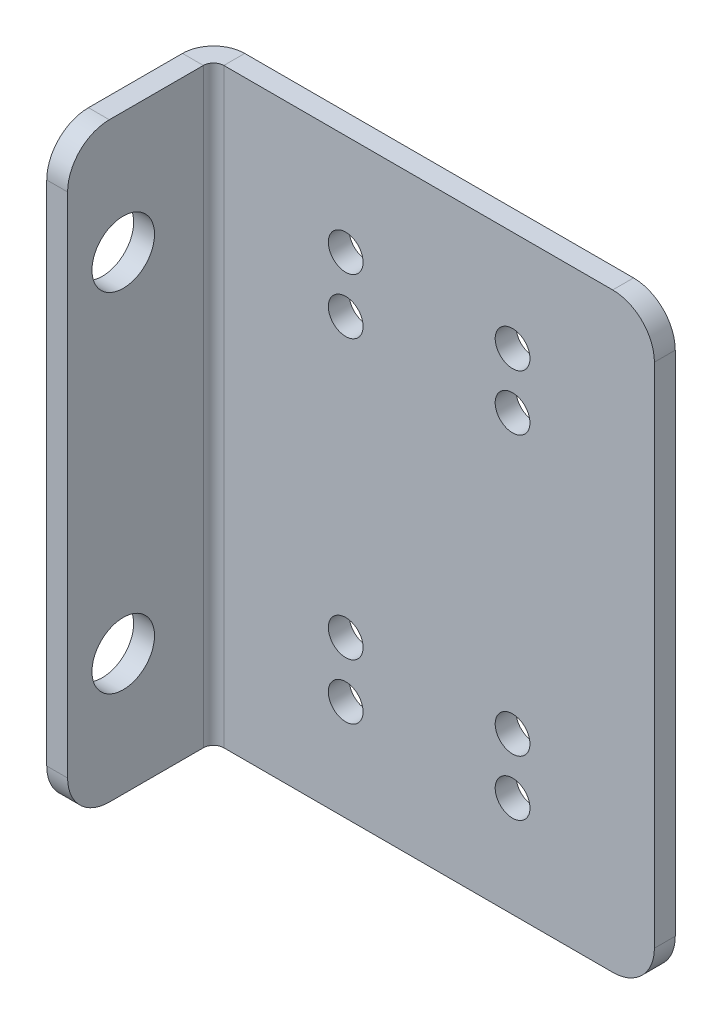
ISO-10303-21;
HEADER;
FILE_DESCRIPTION(('STEP AP214'),'2;1');
FILE_NAME('part.step','',(''),(''),'','','');
FILE_SCHEMA(('AUTOMOTIVE_DESIGN { 1 0 10303 214 1 1 1 1 }'));
ENDSEC;
DATA;
#1=APPLICATION_CONTEXT('core data for automotive mechanical design processes');
#2=APPLICATION_PROTOCOL_DEFINITION('international standard','automotive_design',2000,#1);
#3=PRODUCT_CONTEXT('',#1,'mechanical');
#4=PRODUCT('Part','Part','',(#3));
#5=PRODUCT_RELATED_PRODUCT_CATEGORY('part','',(#4));
#6=PRODUCT_DEFINITION_FORMATION('','',#4);
#7=PRODUCT_DEFINITION_CONTEXT('part definition',#1,'design');
#8=PRODUCT_DEFINITION('design','',#6,#7);
#9=PRODUCT_DEFINITION_SHAPE('','',#8);
#10=(LENGTH_UNIT() NAMED_UNIT(*) SI_UNIT(.MILLI.,.METRE.));
#11=(NAMED_UNIT(*) PLANE_ANGLE_UNIT() SI_UNIT($,.RADIAN.));
#12=(NAMED_UNIT(*) SI_UNIT($,.STERADIAN.) SOLID_ANGLE_UNIT());
#13=UNCERTAINTY_MEASURE_WITH_UNIT(LENGTH_MEASURE(1.E-05),#10,'distance_accuracy_value','');
#14=(GEOMETRIC_REPRESENTATION_CONTEXT(3) GLOBAL_UNCERTAINTY_ASSIGNED_CONTEXT((#13)) GLOBAL_UNIT_ASSIGNED_CONTEXT((#10,
#11,#12)) REPRESENTATION_CONTEXT('',''));
#15=CARTESIAN_POINT('',(0.,0.,0.));
#16=DIRECTION('',(0.,0.,1.));
#17=DIRECTION('',(1.,0.,0.));
#18=AXIS2_PLACEMENT_3D('',#15,#16,#17);
#19=CARTESIAN_POINT('',(16.6,-21.25,-1.5));
#20=DIRECTION('',(0.,-1.,0.));
#21=DIRECTION('',(1.,0.,0.));
#22=AXIS2_PLACEMENT_3D('',#19,#20,#21);
#23=PLANE('',#22);
#24=DIRECTION('',(1.,0.,0.));
#25=VECTOR('',#24,1.);
#26=CARTESIAN_POINT('',(16.6,-21.25,-1.5));
#27=LINE('',#26,#25);
#28=CARTESIAN_POINT('',(-14.3634,-21.25,-1.5));
#29=VERTEX_POINT('',#28);
#30=CARTESIAN_POINT('',(13.6,-21.25,-1.5));
#31=VERTEX_POINT('',#30);
#32=EDGE_CURVE('E246',#29,#31,#27,.T.);
#33=ORIENTED_EDGE('',*,*,#32,.T.);
#34=DIRECTION('',(0.,0.,1.));
#35=VECTOR('',#34,1.);
#36=CARTESIAN_POINT('',(13.6,-21.25,-1.5));
#37=LINE('',#36,#35);
#38=CARTESIAN_POINT('',(13.6,-21.25,0.));
#39=VERTEX_POINT('',#38);
#40=EDGE_CURVE('E287',#31,#39,#37,.T.);
#41=ORIENTED_EDGE('',*,*,#40,.T.);
#42=DIRECTION('',(1.,0.,0.));
#43=VECTOR('',#42,1.);
#44=CARTESIAN_POINT('',(16.6,-21.25,0.));
#45=LINE('',#44,#43);
#46=CARTESIAN_POINT('',(-14.3634,-21.25,0.));
#47=VERTEX_POINT('',#46);
#48=EDGE_CURVE('E242',#47,#39,#45,.T.);
#49=ORIENTED_EDGE('',*,*,#48,.F.);
#50=DIRECTION('',(0.,0.,-1.));
#51=VECTOR('',#50,1.);
#52=CARTESIAN_POINT('',(-14.3634,-21.25,0.));
#53=LINE('',#52,#51);
#54=EDGE_CURVE('E227',#47,#29,#53,.T.);
#55=ORIENTED_EDGE('',*,*,#54,.T.);
#56=EDGE_LOOP('',(#33,#41,#49,#55));
#57=FACE_BOUND('',#56,.T.);
#58=ADVANCED_FACE('F66',(#57),#23,.T.);
#59=CARTESIAN_POINT('',(0.,0.,-1.5));
#60=DIRECTION('',(0.,0.,1.));
#61=DIRECTION('',(1.,0.,0.));
#62=AXIS2_PLACEMENT_3D('',#59,#60,#61);
#63=PLANE('',#62);
#64=CARTESIAN_POINT('',(-5.59999999999984,-14.,-1.5));
#65=DIRECTION('',(0.,0.,1.));
#66=DIRECTION('',(1.,0.,0.));
#67=AXIS2_PLACEMENT_3D('',#64,#65,#66);
#68=CIRCLE('',#67,1.25);
#69=CARTESIAN_POINT('',(-4.34999999999984,-14.,-1.5));
#70=VERTEX_POINT('',#69);
#71=EDGE_CURVE('E387',#70,#70,#68,.F.);
#72=ORIENTED_EDGE('',*,*,#71,.F.);
#73=EDGE_LOOP('',(#72));
#74=FACE_BOUND('',#73,.T.);
#75=CARTESIAN_POINT('',(6.40000000000016,10.,-1.5));
#76=DIRECTION('',(0.,0.,1.));
#77=DIRECTION('',(1.,0.,0.));
#78=AXIS2_PLACEMENT_3D('',#75,#76,#77);
#79=CIRCLE('',#78,1.25);
#80=CARTESIAN_POINT('',(7.65000000000016,10.,-1.5));
#81=VERTEX_POINT('',#80);
#82=EDGE_CURVE('E394',#81,#81,#79,.F.);
#83=ORIENTED_EDGE('',*,*,#82,.F.);
#84=EDGE_LOOP('',(#83));
#85=FACE_BOUND('',#84,.T.);
#86=CARTESIAN_POINT('',(-5.59999999999985,10.,-1.5));
#87=DIRECTION('',(0.,0.,1.));
#88=DIRECTION('',(1.,0.,0.));
#89=AXIS2_PLACEMENT_3D('',#86,#87,#88);
#90=CIRCLE('',#89,1.25);
#91=CARTESIAN_POINT('',(-4.34999999999984,10.,-1.5));
#92=VERTEX_POINT('',#91);
#93=EDGE_CURVE('E398',#92,#92,#90,.F.);
#94=ORIENTED_EDGE('',*,*,#93,.F.);
#95=EDGE_LOOP('',(#94));
#96=FACE_BOUND('',#95,.T.);
#97=CARTESIAN_POINT('',(6.40000000000016,-14.,-1.5));
#98=DIRECTION('',(0.,0.,1.));
#99=DIRECTION('',(1.,0.,0.));
#100=AXIS2_PLACEMENT_3D('',#97,#98,#99);
#101=CIRCLE('',#100,1.25);
#102=CARTESIAN_POINT('',(7.65000000000016,-14.,-1.5));
#103=VERTEX_POINT('',#102);
#104=EDGE_CURVE('E402',#103,#103,#101,.F.);
#105=ORIENTED_EDGE('',*,*,#104,.F.);
#106=EDGE_LOOP('',(#105));
#107=FACE_BOUND('',#106,.T.);
#108=CARTESIAN_POINT('',(-5.59999999999984,14.,-1.5));
#109=DIRECTION('',(0.,0.,1.));
#110=DIRECTION('',(1.,0.,0.));
#111=AXIS2_PLACEMENT_3D('',#108,#109,#110);
#112=CIRCLE('',#111,1.25);
#113=CARTESIAN_POINT('',(-4.34999999999984,14.,-1.5));
#114=VERTEX_POINT('',#113);
#115=EDGE_CURVE('E222',#114,#114,#112,.T.);
#116=ORIENTED_EDGE('',*,*,#115,.T.);
#117=EDGE_LOOP('',(#116));
#118=FACE_BOUND('',#117,.T.);
#119=CARTESIAN_POINT('',(6.40000000000016,-10.,-1.5));
#120=DIRECTION('',(0.,0.,1.));
#121=DIRECTION('',(1.,0.,0.));
#122=AXIS2_PLACEMENT_3D('',#119,#120,#121);
#123=CIRCLE('',#122,1.25);
#124=CARTESIAN_POINT('',(7.65000000000016,-10.,-1.5));
#125=VERTEX_POINT('',#124);
#126=EDGE_CURVE('E346',#125,#125,#123,.T.);
#127=ORIENTED_EDGE('',*,*,#126,.T.);
#128=EDGE_LOOP('',(#127));
#129=FACE_BOUND('',#128,.T.);
#130=CARTESIAN_POINT('',(-5.59999999999985,-10.,-1.5));
#131=DIRECTION('',(0.,0.,1.));
#132=DIRECTION('',(1.,0.,0.));
#133=AXIS2_PLACEMENT_3D('',#130,#131,#132);
#134=CIRCLE('',#133,1.25);
#135=CARTESIAN_POINT('',(-4.34999999999984,-10.,-1.5));
#136=VERTEX_POINT('',#135);
#137=EDGE_CURVE('E350',#136,#136,#134,.T.);
#138=ORIENTED_EDGE('',*,*,#137,.T.);
#139=EDGE_LOOP('',(#138));
#140=FACE_BOUND('',#139,.T.);
#141=CARTESIAN_POINT('',(6.40000000000016,14.,-1.5));
#142=DIRECTION('',(0.,0.,1.));
#143=DIRECTION('',(1.,0.,0.));
#144=AXIS2_PLACEMENT_3D('',#141,#142,#143);
#145=CIRCLE('',#144,1.25);
#146=CARTESIAN_POINT('',(7.65000000000016,14.,-1.5));
#147=VERTEX_POINT('',#146);
#148=EDGE_CURVE('E354',#147,#147,#145,.T.);
#149=ORIENTED_EDGE('',*,*,#148,.T.);
#150=EDGE_LOOP('',(#149));
#151=FACE_BOUND('',#150,.T.);
#152=DIRECTION('',(0.,1.,0.));
#153=VECTOR('',#152,1.);
#154=CARTESIAN_POINT('',(16.6,-21.25,-1.5));
#155=LINE('',#154,#153);
#156=CARTESIAN_POINT('',(16.6,-18.25,-1.5));
#157=VERTEX_POINT('',#156);
#158=CARTESIAN_POINT('',(16.6,18.25,-1.5));
#159=VERTEX_POINT('',#158);
#160=EDGE_CURVE('E250',#157,#159,#155,.T.);
#161=ORIENTED_EDGE('',*,*,#160,.F.);
#162=CARTESIAN_POINT('',(13.6,-18.25,-1.5));
#163=DIRECTION('',(0.,0.,1.));
#164=DIRECTION('',(1.,0.,0.));
#165=AXIS2_PLACEMENT_3D('',#162,#163,#164);
#166=CIRCLE('',#165,3.);
#167=EDGE_CURVE('E306',#157,#31,#166,.F.);
#168=ORIENTED_EDGE('',*,*,#167,.T.);
#169=ORIENTED_EDGE('',*,*,#32,.F.);
#170=DIRECTION('',(0.,-1.,0.));
#171=VECTOR('',#170,1.);
#172=CARTESIAN_POINT('',(-14.3634,-21.25,-1.5));
#173=LINE('',#172,#171);
#174=CARTESIAN_POINT('',(-14.3634,21.25,-1.5));
#175=VERTEX_POINT('',#174);
#176=EDGE_CURVE('E166',#29,#175,#173,.F.);
#177=ORIENTED_EDGE('',*,*,#176,.T.);
#178=DIRECTION('',(-1.,0.,0.));
#179=VECTOR('',#178,1.);
#180=CARTESIAN_POINT('',(16.6,21.25,-1.5));
#181=LINE('',#180,#179);
#182=CARTESIAN_POINT('',(13.6,21.25,-1.5));
#183=VERTEX_POINT('',#182);
#184=EDGE_CURVE('E254',#183,#175,#181,.T.);
#185=ORIENTED_EDGE('',*,*,#184,.F.);
#186=CARTESIAN_POINT('',(13.6,18.25,-1.5));
#187=DIRECTION('',(0.,0.,1.));
#188=DIRECTION('',(1.,0.,0.));
#189=AXIS2_PLACEMENT_3D('',#186,#187,#188);
#190=CIRCLE('',#189,3.);
#191=EDGE_CURVE('E88',#183,#159,#190,.F.);
#192=ORIENTED_EDGE('',*,*,#191,.T.);
#193=EDGE_LOOP('',(#161,#168,#169,#177,#185,#192));
#194=FACE_BOUND('',#193,.T.);
#195=ADVANCED_FACE('F435',(#74,#85,#96,#107,#118,#129,#140,#151,#194),#63,.F.);
#196=CARTESIAN_POINT('',(0.,0.,0.));
#197=DIRECTION('',(0.,0.,1.));
#198=DIRECTION('',(1.,0.,0.));
#199=AXIS2_PLACEMENT_3D('',#196,#197,#198);
#200=PLANE('',#199);
#201=CARTESIAN_POINT('',(-5.59999999999984,-14.,0.));
#202=DIRECTION('',(0.,0.,-1.));
#203=DIRECTION('',(1.,0.,0.));
#204=AXIS2_PLACEMENT_3D('',#201,#202,#203);
#205=CIRCLE('',#204,1.25);
#206=CARTESIAN_POINT('',(-4.34999999999984,-14.,0.));
#207=VERTEX_POINT('',#206);
#208=EDGE_CURVE('E410',#207,#207,#205,.T.);
#209=ORIENTED_EDGE('',*,*,#208,.T.);
#210=EDGE_LOOP('',(#209));
#211=FACE_BOUND('',#210,.T.);
#212=CARTESIAN_POINT('',(6.40000000000016,10.,0.));
#213=DIRECTION('',(0.,0.,-1.));
#214=DIRECTION('',(1.,0.,0.));
#215=AXIS2_PLACEMENT_3D('',#212,#213,#214);
#216=CIRCLE('',#215,1.25);
#217=CARTESIAN_POINT('',(7.65000000000016,10.,0.));
#218=VERTEX_POINT('',#217);
#219=EDGE_CURVE('E411',#218,#218,#216,.T.);
#220=ORIENTED_EDGE('',*,*,#219,.T.);
#221=EDGE_LOOP('',(#220));
#222=FACE_BOUND('',#221,.T.);
#223=CARTESIAN_POINT('',(-5.59999999999985,10.,0.));
#224=DIRECTION('',(0.,0.,-1.));
#225=DIRECTION('',(1.,0.,0.));
#226=AXIS2_PLACEMENT_3D('',#223,#224,#225);
#227=CIRCLE('',#226,1.25);
#228=CARTESIAN_POINT('',(-4.34999999999984,10.,0.));
#229=VERTEX_POINT('',#228);
#230=EDGE_CURVE('E415',#229,#229,#227,.T.);
#231=ORIENTED_EDGE('',*,*,#230,.T.);
#232=EDGE_LOOP('',(#231));
#233=FACE_BOUND('',#232,.T.);
#234=CARTESIAN_POINT('',(6.40000000000016,-14.,0.));
#235=DIRECTION('',(0.,0.,-1.));
#236=DIRECTION('',(1.,0.,0.));
#237=AXIS2_PLACEMENT_3D('',#234,#235,#236);
#238=CIRCLE('',#237,1.25);
#239=CARTESIAN_POINT('',(7.65000000000016,-14.,0.));
#240=VERTEX_POINT('',#239);
#241=EDGE_CURVE('E406',#240,#240,#238,.T.);
#242=ORIENTED_EDGE('',*,*,#241,.T.);
#243=EDGE_LOOP('',(#242));
#244=FACE_BOUND('',#243,.T.);
#245=CARTESIAN_POINT('',(-5.59999999999984,14.,0.));
#246=DIRECTION('',(0.,0.,1.));
#247=DIRECTION('',(1.,0.,0.));
#248=AXIS2_PLACEMENT_3D('',#245,#246,#247);
#249=CIRCLE('',#248,1.25);
#250=CARTESIAN_POINT('',(-4.34999999999984,14.,0.));
#251=VERTEX_POINT('',#250);
#252=EDGE_CURVE('E362',#251,#251,#249,.T.);
#253=ORIENTED_EDGE('',*,*,#252,.F.);
#254=EDGE_LOOP('',(#253));
#255=FACE_BOUND('',#254,.T.);
#256=CARTESIAN_POINT('',(6.40000000000016,-10.,0.));
#257=DIRECTION('',(0.,0.,1.));
#258=DIRECTION('',(1.,0.,0.));
#259=AXIS2_PLACEMENT_3D('',#256,#257,#258);
#260=CIRCLE('',#259,1.25);
#261=CARTESIAN_POINT('',(7.65000000000016,-10.,0.));
#262=VERTEX_POINT('',#261);
#263=EDGE_CURVE('E363',#262,#262,#260,.T.);
#264=ORIENTED_EDGE('',*,*,#263,.F.);
#265=EDGE_LOOP('',(#264));
#266=FACE_BOUND('',#265,.T.);
#267=CARTESIAN_POINT('',(-5.59999999999985,-10.,0.));
#268=DIRECTION('',(0.,0.,1.));
#269=DIRECTION('',(1.,0.,0.));
#270=AXIS2_PLACEMENT_3D('',#267,#268,#269);
#271=CIRCLE('',#270,1.25);
#272=CARTESIAN_POINT('',(-4.34999999999984,-10.,0.));
#273=VERTEX_POINT('',#272);
#274=EDGE_CURVE('E367',#273,#273,#271,.T.);
#275=ORIENTED_EDGE('',*,*,#274,.F.);
#276=EDGE_LOOP('',(#275));
#277=FACE_BOUND('',#276,.T.);
#278=CARTESIAN_POINT('',(6.40000000000016,14.,0.));
#279=DIRECTION('',(0.,0.,1.));
#280=DIRECTION('',(1.,0.,0.));
#281=AXIS2_PLACEMENT_3D('',#278,#279,#280);
#282=CIRCLE('',#281,1.25);
#283=CARTESIAN_POINT('',(7.65000000000016,14.,0.));
#284=VERTEX_POINT('',#283);
#285=EDGE_CURVE('E358',#284,#284,#282,.T.);
#286=ORIENTED_EDGE('',*,*,#285,.F.);
#287=EDGE_LOOP('',(#286));
#288=FACE_BOUND('',#287,.T.);
#289=ORIENTED_EDGE('',*,*,#48,.T.);
#290=CARTESIAN_POINT('',(13.6,-18.25,0.));
#291=DIRECTION('',(0.,0.,1.));
#292=DIRECTION('',(1.,0.,0.));
#293=AXIS2_PLACEMENT_3D('',#290,#291,#292);
#294=CIRCLE('',#293,3.);
#295=CARTESIAN_POINT('',(16.6,-18.25,0.));
#296=VERTEX_POINT('',#295);
#297=EDGE_CURVE('E294',#39,#296,#294,.T.);
#298=ORIENTED_EDGE('',*,*,#297,.T.);
#299=DIRECTION('',(0.,1.,0.));
#300=VECTOR('',#299,1.);
#301=CARTESIAN_POINT('',(16.6,-21.25,0.));
#302=LINE('',#301,#300);
#303=CARTESIAN_POINT('',(16.6,18.25,0.));
#304=VERTEX_POINT('',#303);
#305=EDGE_CURVE('E261',#296,#304,#302,.T.);
#306=ORIENTED_EDGE('',*,*,#305,.T.);
#307=CARTESIAN_POINT('',(13.6,18.25,0.));
#308=DIRECTION('',(0.,0.,1.));
#309=DIRECTION('',(1.,0.,0.));
#310=AXIS2_PLACEMENT_3D('',#307,#308,#309);
#311=CIRCLE('',#310,3.);
#312=CARTESIAN_POINT('',(13.6,21.25,0.));
#313=VERTEX_POINT('',#312);
#314=EDGE_CURVE('E291',#304,#313,#311,.T.);
#315=ORIENTED_EDGE('',*,*,#314,.T.);
#316=DIRECTION('',(-1.,0.,0.));
#317=VECTOR('',#316,1.);
#318=CARTESIAN_POINT('',(16.6,21.25,0.));
#319=LINE('',#318,#317);
#320=CARTESIAN_POINT('',(-14.3634,21.25,0.));
#321=VERTEX_POINT('',#320);
#322=EDGE_CURVE('E251',#313,#321,#319,.T.);
#323=ORIENTED_EDGE('',*,*,#322,.T.);
#324=DIRECTION('',(0.,-1.,0.));
#325=VECTOR('',#324,1.);
#326=CARTESIAN_POINT('',(-14.3634,-21.25,0.));
#327=LINE('',#326,#325);
#328=EDGE_CURVE('E232',#47,#321,#327,.F.);
#329=ORIENTED_EDGE('',*,*,#328,.F.);
#330=EDGE_LOOP('',(#289,#298,#306,#315,#323,#329));
#331=FACE_BOUND('',#330,.T.);
#332=ADVANCED_FACE('F424',(#211,#222,#233,#244,#255,#266,#277,#288,#331),#200,.T.);
#333=CARTESIAN_POINT('',(16.6,21.25,-1.5));
#334=DIRECTION('',(0.,1.,0.));
#335=DIRECTION('',(0.,0.,1.));
#336=AXIS2_PLACEMENT_3D('',#333,#334,#335);
#337=PLANE('',#336);
#338=ORIENTED_EDGE('',*,*,#322,.F.);
#339=DIRECTION('',(0.,0.,1.));
#340=VECTOR('',#339,1.);
#341=CARTESIAN_POINT('',(13.6,21.25,-1.5));
#342=LINE('',#341,#340);
#343=EDGE_CURVE('E75',#313,#183,#342,.F.);
#344=ORIENTED_EDGE('',*,*,#343,.T.);
#345=ORIENTED_EDGE('',*,*,#184,.T.);
#346=DIRECTION('',(0.,0.,-1.));
#347=VECTOR('',#346,1.);
#348=CARTESIAN_POINT('',(-14.3634,21.25,0.));
#349=LINE('',#348,#347);
#350=EDGE_CURVE('E238',#321,#175,#349,.T.);
#351=ORIENTED_EDGE('',*,*,#350,.F.);
#352=EDGE_LOOP('',(#338,#344,#345,#351));
#353=FACE_BOUND('',#352,.T.);
#354=ADVANCED_FACE('F540',(#353),#337,.T.);
#355=CARTESIAN_POINT('',(16.6,-21.25,-1.5));
#356=DIRECTION('',(1.,0.,0.));
#357=DIRECTION('',(0.,0.,-1.));
#358=AXIS2_PLACEMENT_3D('',#355,#356,#357);
#359=PLANE('',#358);
#360=ORIENTED_EDGE('',*,*,#305,.F.);
#361=DIRECTION('',(0.,0.,1.));
#362=VECTOR('',#361,1.);
#363=CARTESIAN_POINT('',(16.6,-18.25,-1.5));
#364=LINE('',#363,#362);
#365=EDGE_CURVE('E301',#296,#157,#364,.F.);
#366=ORIENTED_EDGE('',*,*,#365,.T.);
#367=ORIENTED_EDGE('',*,*,#160,.T.);
#368=DIRECTION('',(0.,0.,1.));
#369=VECTOR('',#368,1.);
#370=CARTESIAN_POINT('',(16.6,18.25,-1.5));
#371=LINE('',#370,#369);
#372=EDGE_CURVE('E297',#159,#304,#371,.T.);
#373=ORIENTED_EDGE('',*,*,#372,.T.);
#374=EDGE_LOOP('',(#360,#366,#367,#373));
#375=FACE_BOUND('',#374,.T.);
#376=ADVANCED_FACE('F496',(#375),#359,.T.);
#377=CARTESIAN_POINT('',(-14.3634,21.25,0.7366));
#378=DIRECTION('',(0.,1.,0.));
#379=DIRECTION('',(0.,0.,1.));
#380=AXIS2_PLACEMENT_3D('',#377,#378,#379);
#381=PLANE('',#380);
#382=DIRECTION('',(1.,0.,0.));
#383=VECTOR('',#382,1.);
#384=CARTESIAN_POINT('',(-16.6,21.25,0.736599999999991));
#385=LINE('',#384,#383);
#386=CARTESIAN_POINT('',(-15.1,21.25,0.736599999999997));
#387=VERTEX_POINT('',#386);
#388=CARTESIAN_POINT('',(-16.6,21.25,0.736599999999991));
#389=VERTEX_POINT('',#388);
#390=EDGE_CURVE('E218',#387,#389,#385,.F.);
#391=ORIENTED_EDGE('',*,*,#390,.F.);
#392=CARTESIAN_POINT('',(-14.3634,21.25,0.7366));
#393=DIRECTION('',(0.,-1.,0.));
#394=DIRECTION('',(0.,0.,-1.));
#395=AXIS2_PLACEMENT_3D('',#392,#393,#394);
#396=CIRCLE('',#395,0.7366);
#397=EDGE_CURVE('E170',#321,#387,#396,.F.);
#398=ORIENTED_EDGE('',*,*,#397,.F.);
#399=ORIENTED_EDGE('',*,*,#350,.T.);
#400=CARTESIAN_POINT('',(-14.3634,21.25,0.7366));
#401=DIRECTION('',(0.,-1.,0.));
#402=DIRECTION('',(0.,0.,-1.));
#403=AXIS2_PLACEMENT_3D('',#400,#401,#402);
#404=CIRCLE('',#403,2.2366);
#405=EDGE_CURVE('E225',#175,#389,#404,.F.);
#406=ORIENTED_EDGE('',*,*,#405,.T.);
#407=EDGE_LOOP('',(#391,#398,#399,#406));
#408=FACE_BOUND('',#407,.T.);
#409=ADVANCED_FACE('F467',(#408),#381,.T.);
#410=CARTESIAN_POINT('',(-14.3634,-21.25,0.7366));
#411=DIRECTION('',(0.,1.,0.));
#412=DIRECTION('',(0.,0.,1.));
#413=AXIS2_PLACEMENT_3D('',#410,#411,#412);
#414=PLANE('',#413);
#415=CARTESIAN_POINT('',(-14.3634,-21.25,0.7366));
#416=DIRECTION('',(0.,-1.,0.));
#417=DIRECTION('',(0.,0.,-1.));
#418=AXIS2_PLACEMENT_3D('',#415,#416,#417);
#419=CIRCLE('',#418,0.7366);
#420=CARTESIAN_POINT('',(-15.1,-21.25,0.736599999999997));
#421=VERTEX_POINT('',#420);
#422=EDGE_CURVE('E177',#421,#47,#419,.T.);
#423=ORIENTED_EDGE('',*,*,#422,.F.);
#424=DIRECTION('',(1.,0.,0.));
#425=VECTOR('',#424,1.);
#426=CARTESIAN_POINT('',(-15.1,-21.25,0.736599999999997));
#427=LINE('',#426,#425);
#428=CARTESIAN_POINT('',(-16.6,-21.25,0.736599999999991));
#429=VERTEX_POINT('',#428);
#430=EDGE_CURVE('E174',#421,#429,#427,.F.);
#431=ORIENTED_EDGE('',*,*,#430,.T.);
#432=CARTESIAN_POINT('',(-14.3634,-21.25,0.7366));
#433=DIRECTION('',(0.,-1.,0.));
#434=DIRECTION('',(0.,0.,-1.));
#435=AXIS2_PLACEMENT_3D('',#432,#433,#434);
#436=CIRCLE('',#435,2.2366);
#437=EDGE_CURVE('E158',#429,#29,#436,.T.);
#438=ORIENTED_EDGE('',*,*,#437,.T.);
#439=ORIENTED_EDGE('',*,*,#54,.F.);
#440=EDGE_LOOP('',(#423,#431,#438,#439));
#441=FACE_BOUND('',#440,.T.);
#442=ADVANCED_FACE('F175',(#441),#414,.F.);
#443=CARTESIAN_POINT('',(-14.3634,-21.25,0.7366));
#444=DIRECTION('',(0.,-1.,0.));
#445=DIRECTION('',(-1.,0.,0.));
#446=AXIS2_PLACEMENT_3D('',#443,#444,#445);
#447=CYLINDRICAL_SURFACE('',#446,2.2366);
#448=ORIENTED_EDGE('',*,*,#176,.F.);
#449=ORIENTED_EDGE('',*,*,#437,.F.);
#450=DIRECTION('',(0.,-1.,0.));
#451=VECTOR('',#450,1.);
#452=CARTESIAN_POINT('',(-16.6,21.25,0.736599999999991));
#453=LINE('',#452,#451);
#454=EDGE_CURVE('E163',#429,#389,#453,.F.);
#455=ORIENTED_EDGE('',*,*,#454,.T.);
#456=ORIENTED_EDGE('',*,*,#405,.F.);
#457=EDGE_LOOP('',(#448,#449,#455,#456));
#458=FACE_BOUND('',#457,.T.);
#459=ADVANCED_FACE('F160',(#458),#447,.T.);
#460=CARTESIAN_POINT('',(-14.3634,-21.25,0.7366));
#461=DIRECTION('',(0.,-1.,0.));
#462=DIRECTION('',(-1.,0.,0.));
#463=AXIS2_PLACEMENT_3D('',#460,#461,#462);
#464=CYLINDRICAL_SURFACE('',#463,0.7366);
#465=ORIENTED_EDGE('',*,*,#328,.T.);
#466=ORIENTED_EDGE('',*,*,#397,.T.);
#467=DIRECTION('',(0.,-1.,0.));
#468=VECTOR('',#467,1.);
#469=CARTESIAN_POINT('',(-15.1,21.25,0.736599999999997));
#470=LINE('',#469,#468);
#471=EDGE_CURVE('E183',#387,#421,#470,.T.);
#472=ORIENTED_EDGE('',*,*,#471,.T.);
#473=ORIENTED_EDGE('',*,*,#422,.T.);
#474=EDGE_LOOP('',(#465,#466,#472,#473));
#475=FACE_BOUND('',#474,.T.);
#476=ADVANCED_FACE('F463',(#475),#464,.F.);
#477=CARTESIAN_POINT('',(-16.6,-21.25,10.5));
#478=DIRECTION('',(0.,1.,0.));
#479=DIRECTION('',(0.,0.,1.));
#480=AXIS2_PLACEMENT_3D('',#477,#478,#479);
#481=PLANE('',#480);
#482=DIRECTION('',(0.,0.,-1.));
#483=VECTOR('',#482,1.);
#484=CARTESIAN_POINT('',(-15.1,-21.25,10.5));
#485=LINE('',#484,#483);
#486=CARTESIAN_POINT('',(-15.1,-21.25,7.50000000000001));
#487=VERTEX_POINT('',#486);
#488=EDGE_CURVE('E193',#421,#487,#485,.F.);
#489=ORIENTED_EDGE('',*,*,#488,.T.);
#490=DIRECTION('',(1.,0.,0.));
#491=VECTOR('',#490,1.);
#492=CARTESIAN_POINT('',(-16.6,-21.25,7.5));
#493=LINE('',#492,#491);
#494=CARTESIAN_POINT('',(-16.6,-21.25,7.5));
#495=VERTEX_POINT('',#494);
#496=EDGE_CURVE('E197',#487,#495,#493,.F.);
#497=ORIENTED_EDGE('',*,*,#496,.T.);
#498=DIRECTION('',(0.,0.,1.));
#499=VECTOR('',#498,1.);
#500=CARTESIAN_POINT('',(-16.6,-21.25,0.));
#501=LINE('',#500,#499);
#502=EDGE_CURVE('E188',#429,#495,#501,.T.);
#503=ORIENTED_EDGE('',*,*,#502,.F.);
#504=ORIENTED_EDGE('',*,*,#430,.F.);
#505=EDGE_LOOP('',(#489,#497,#503,#504));
#506=FACE_BOUND('',#505,.T.);
#507=ADVANCED_FACE('F195',(#506),#481,.F.);
#508=CARTESIAN_POINT('',(-16.6,21.25,0.));
#509=DIRECTION('',(0.,-1.,0.));
#510=DIRECTION('',(0.,0.,-1.));
#511=AXIS2_PLACEMENT_3D('',#508,#509,#510);
#512=PLANE('',#511);
#513=DIRECTION('',(0.,0.,-1.));
#514=VECTOR('',#513,1.);
#515=CARTESIAN_POINT('',(-16.6,21.25,0.));
#516=LINE('',#515,#514);
#517=CARTESIAN_POINT('',(-16.6,21.25,7.5));
#518=VERTEX_POINT('',#517);
#519=EDGE_CURVE('E191',#518,#389,#516,.T.);
#520=ORIENTED_EDGE('',*,*,#519,.F.);
#521=DIRECTION('',(1.,0.,0.));
#522=VECTOR('',#521,1.);
#523=CARTESIAN_POINT('',(-16.6,21.25,7.5));
#524=LINE('',#523,#522);
#525=CARTESIAN_POINT('',(-15.1,21.25,7.50000000000001));
#526=VERTEX_POINT('',#525);
#527=EDGE_CURVE('E13',#518,#526,#524,.T.);
#528=ORIENTED_EDGE('',*,*,#527,.T.);
#529=DIRECTION('',(0.,0.,1.));
#530=VECTOR('',#529,1.);
#531=CARTESIAN_POINT('',(-15.1,21.25,0.));
#532=LINE('',#531,#530);
#533=EDGE_CURVE('E200',#526,#387,#532,.F.);
#534=ORIENTED_EDGE('',*,*,#533,.T.);
#535=ORIENTED_EDGE('',*,*,#390,.T.);
#536=EDGE_LOOP('',(#520,#528,#534,#535));
#537=FACE_BOUND('',#536,.T.);
#538=ADVANCED_FACE('F469',(#537),#512,.F.);
#539=CARTESIAN_POINT('',(-16.6,0.,0.));
#540=DIRECTION('',(1.,0.,0.));
#541=DIRECTION('',(0.,0.,-1.));
#542=AXIS2_PLACEMENT_3D('',#539,#540,#541);
#543=PLANE('',#542);
#544=CARTESIAN_POINT('',(-16.6,12.5,6.5));
#545=DIRECTION('',(1.,0.,0.));
#546=DIRECTION('',(0.,0.,-1.));
#547=AXIS2_PLACEMENT_3D('',#544,#545,#546);
#548=CIRCLE('',#547,2.25);
#549=CARTESIAN_POINT('',(-16.6,12.5,4.25));
#550=VERTEX_POINT('',#549);
#551=EDGE_CURVE('E374',#550,#550,#548,.T.);
#552=ORIENTED_EDGE('',*,*,#551,.T.);
#553=EDGE_LOOP('',(#552));
#554=FACE_BOUND('',#553,.T.);
#555=CARTESIAN_POINT('',(-16.6,-12.5,6.5));
#556=DIRECTION('',(1.,0.,0.));
#557=DIRECTION('',(0.,0.,-1.));
#558=AXIS2_PLACEMENT_3D('',#555,#556,#557);
#559=CIRCLE('',#558,2.25);
#560=CARTESIAN_POINT('',(-16.6,-12.5,4.25));
#561=VERTEX_POINT('',#560);
#562=EDGE_CURVE('E378',#561,#561,#559,.T.);
#563=ORIENTED_EDGE('',*,*,#562,.T.);
#564=EDGE_LOOP('',(#563));
#565=FACE_BOUND('',#564,.T.);
#566=ORIENTED_EDGE('',*,*,#502,.T.);
#567=CARTESIAN_POINT('',(-16.6,-18.25,7.5));
#568=DIRECTION('',(1.,0.,0.));
#569=DIRECTION('',(0.,0.,-1.));
#570=AXIS2_PLACEMENT_3D('',#567,#568,#569);
#571=CIRCLE('',#570,3.);
#572=CARTESIAN_POINT('',(-16.6,-18.25,10.5));
#573=VERTEX_POINT('',#572);
#574=EDGE_CURVE('E284',#495,#573,#571,.F.);
#575=ORIENTED_EDGE('',*,*,#574,.T.);
#576=DIRECTION('',(0.,1.,0.));
#577=VECTOR('',#576,1.);
#578=CARTESIAN_POINT('',(-16.6,0.,10.5));
#579=LINE('',#578,#577);
#580=CARTESIAN_POINT('',(-16.6,18.25,10.5));
#581=VERTEX_POINT('',#580);
#582=EDGE_CURVE('E199',#573,#581,#579,.T.);
#583=ORIENTED_EDGE('',*,*,#582,.T.);
#584=CARTESIAN_POINT('',(-16.6,18.25,7.5));
#585=DIRECTION('',(1.,0.,0.));
#586=DIRECTION('',(0.,0.,-1.));
#587=AXIS2_PLACEMENT_3D('',#584,#585,#586);
#588=CIRCLE('',#587,3.);
#589=EDGE_CURVE('E281',#581,#518,#588,.F.);
#590=ORIENTED_EDGE('',*,*,#589,.T.);
#591=ORIENTED_EDGE('',*,*,#519,.T.);
#592=ORIENTED_EDGE('',*,*,#454,.F.);
#593=EDGE_LOOP('',(#566,#575,#583,#590,#591,#592));
#594=FACE_BOUND('',#593,.T.);
#595=ADVANCED_FACE('F187',(#554,#565,#594),#543,.F.);
#596=CARTESIAN_POINT('',(-15.1,0.,0.));
#597=DIRECTION('',(1.,0.,0.));
#598=DIRECTION('',(0.,0.,-1.));
#599=AXIS2_PLACEMENT_3D('',#596,#597,#598);
#600=PLANE('',#599);
#601=CARTESIAN_POINT('',(-15.1,12.5,6.50000000000001));
#602=DIRECTION('',(1.,0.,0.));
#603=DIRECTION('',(0.,0.,-1.));
#604=AXIS2_PLACEMENT_3D('',#601,#602,#603);
#605=CIRCLE('',#604,2.25);
#606=CARTESIAN_POINT('',(-15.1,12.5,4.25000000000001));
#607=VERTEX_POINT('',#606);
#608=EDGE_CURVE('E382',#607,#607,#605,.T.);
#609=ORIENTED_EDGE('',*,*,#608,.F.);
#610=EDGE_LOOP('',(#609));
#611=FACE_BOUND('',#610,.T.);
#612=CARTESIAN_POINT('',(-15.1,-12.5,6.5));
#613=DIRECTION('',(1.,0.,0.));
#614=DIRECTION('',(0.,0.,-1.));
#615=AXIS2_PLACEMENT_3D('',#612,#613,#614);
#616=CIRCLE('',#615,2.25);
#617=CARTESIAN_POINT('',(-15.1,-12.5,4.25));
#618=VERTEX_POINT('',#617);
#619=EDGE_CURVE('E383',#618,#618,#616,.T.);
#620=ORIENTED_EDGE('',*,*,#619,.F.);
#621=EDGE_LOOP('',(#620));
#622=FACE_BOUND('',#621,.T.);
#623=DIRECTION('',(0.,-1.,0.));
#624=VECTOR('',#623,1.);
#625=CARTESIAN_POINT('',(-15.1,21.25,10.5));
#626=LINE('',#625,#624);
#627=CARTESIAN_POINT('',(-15.1,-18.25,10.5));
#628=VERTEX_POINT('',#627);
#629=CARTESIAN_POINT('',(-15.1,18.25,10.5));
#630=VERTEX_POINT('',#629);
#631=EDGE_CURVE('E207',#628,#630,#626,.F.);
#632=ORIENTED_EDGE('',*,*,#631,.F.);
#633=CARTESIAN_POINT('',(-15.1,-18.25,7.50000000000001));
#634=DIRECTION('',(1.,0.,0.));
#635=DIRECTION('',(0.,0.,-1.));
#636=AXIS2_PLACEMENT_3D('',#633,#634,#635);
#637=CIRCLE('',#636,3.);
#638=EDGE_CURVE('E276',#628,#487,#637,.T.);
#639=ORIENTED_EDGE('',*,*,#638,.T.);
#640=ORIENTED_EDGE('',*,*,#488,.F.);
#641=ORIENTED_EDGE('',*,*,#471,.F.);
#642=ORIENTED_EDGE('',*,*,#533,.F.);
#643=CARTESIAN_POINT('',(-15.1,18.25,7.50000000000001));
#644=DIRECTION('',(1.,0.,0.));
#645=DIRECTION('',(0.,0.,-1.));
#646=AXIS2_PLACEMENT_3D('',#643,#644,#645);
#647=CIRCLE('',#646,3.);
#648=EDGE_CURVE('E273',#526,#630,#647,.T.);
#649=ORIENTED_EDGE('',*,*,#648,.T.);
#650=EDGE_LOOP('',(#632,#639,#640,#641,#642,#649));
#651=FACE_BOUND('',#650,.T.);
#652=ADVANCED_FACE('F474',(#611,#622,#651),#600,.T.);
#653=CARTESIAN_POINT('',(-16.6,21.25,10.5));
#654=DIRECTION('',(0.,0.,-1.));
#655=DIRECTION('',(-1.,0.,0.));
#656=AXIS2_PLACEMENT_3D('',#653,#654,#655);
#657=PLANE('',#656);
#658=ORIENTED_EDGE('',*,*,#582,.F.);
#659=DIRECTION('',(1.,0.,0.));
#660=VECTOR('',#659,1.);
#661=CARTESIAN_POINT('',(-16.6,-18.25,10.5));
#662=LINE('',#661,#660);
#663=EDGE_CURVE('E269',#573,#628,#662,.T.);
#664=ORIENTED_EDGE('',*,*,#663,.T.);
#665=ORIENTED_EDGE('',*,*,#631,.T.);
#666=DIRECTION('',(1.,0.,0.));
#667=VECTOR('',#666,1.);
#668=CARTESIAN_POINT('',(-16.6,18.25,10.5));
#669=LINE('',#668,#667);
#670=EDGE_CURVE('E257',#630,#581,#669,.F.);
#671=ORIENTED_EDGE('',*,*,#670,.T.);
#672=EDGE_LOOP('',(#658,#664,#665,#671));
#673=FACE_BOUND('',#672,.T.);
#674=ADVANCED_FACE('F481',(#673),#657,.F.);
#675=CARTESIAN_POINT('',(6.40000000000016,14.,-10.));
#676=DIRECTION('',(0.,0.,1.));
#677=DIRECTION('',(1.,0.,0.));
#678=AXIS2_PLACEMENT_3D('',#675,#676,#677);
#679=CYLINDRICAL_SURFACE('',#678,1.25);
#680=ORIENTED_EDGE('',*,*,#285,.T.);
#681=EDGE_LOOP('',(#680));
#682=FACE_BOUND('',#681,.T.);
#683=ORIENTED_EDGE('',*,*,#148,.F.);
#684=EDGE_LOOP('',(#683));
#685=FACE_BOUND('',#684,.T.);
#686=ADVANCED_FACE('F614',(#682,#685),#679,.F.);
#687=CARTESIAN_POINT('',(-5.59999999999985,-10.,-10.));
#688=DIRECTION('',(0.,0.,1.));
#689=DIRECTION('',(1.,0.,0.));
#690=AXIS2_PLACEMENT_3D('',#687,#688,#689);
#691=CYLINDRICAL_SURFACE('',#690,1.25);
#692=ORIENTED_EDGE('',*,*,#274,.T.);
#693=EDGE_LOOP('',(#692));
#694=FACE_BOUND('',#693,.T.);
#695=ORIENTED_EDGE('',*,*,#137,.F.);
#696=EDGE_LOOP('',(#695));
#697=FACE_BOUND('',#696,.T.);
#698=ADVANCED_FACE('F620',(#694,#697),#691,.F.);
#699=CARTESIAN_POINT('',(6.40000000000016,-10.,-10.));
#700=DIRECTION('',(0.,0.,1.));
#701=DIRECTION('',(1.,0.,0.));
#702=AXIS2_PLACEMENT_3D('',#699,#700,#701);
#703=CYLINDRICAL_SURFACE('',#702,1.25);
#704=ORIENTED_EDGE('',*,*,#263,.T.);
#705=EDGE_LOOP('',(#704));
#706=FACE_BOUND('',#705,.T.);
#707=ORIENTED_EDGE('',*,*,#126,.F.);
#708=EDGE_LOOP('',(#707));
#709=FACE_BOUND('',#708,.T.);
#710=ADVANCED_FACE('F628',(#706,#709),#703,.F.);
#711=CARTESIAN_POINT('',(-5.59999999999984,14.,-10.));
#712=DIRECTION('',(0.,0.,1.));
#713=DIRECTION('',(1.,0.,0.));
#714=AXIS2_PLACEMENT_3D('',#711,#712,#713);
#715=CYLINDRICAL_SURFACE('',#714,1.25);
#716=ORIENTED_EDGE('',*,*,#252,.T.);
#717=EDGE_LOOP('',(#716));
#718=FACE_BOUND('',#717,.T.);
#719=ORIENTED_EDGE('',*,*,#115,.F.);
#720=EDGE_LOOP('',(#719));
#721=FACE_BOUND('',#720,.T.);
#722=ADVANCED_FACE('F636',(#718,#721),#715,.F.);
#723=CARTESIAN_POINT('',(-25.1,-12.5,6.49999999999997));
#724=DIRECTION('',(1.,0.,0.));
#725=DIRECTION('',(0.,0.,-1.));
#726=AXIS2_PLACEMENT_3D('',#723,#724,#725);
#727=CYLINDRICAL_SURFACE('',#726,2.25);
#728=ORIENTED_EDGE('',*,*,#619,.T.);
#729=EDGE_LOOP('',(#728));
#730=FACE_BOUND('',#729,.T.);
#731=ORIENTED_EDGE('',*,*,#562,.F.);
#732=EDGE_LOOP('',(#731));
#733=FACE_BOUND('',#732,.T.);
#734=ADVANCED_FACE('F644',(#730,#733),#727,.F.);
#735=CARTESIAN_POINT('',(-25.1,12.5,6.49999999999997));
#736=DIRECTION('',(1.,0.,0.));
#737=DIRECTION('',(0.,0.,-1.));
#738=AXIS2_PLACEMENT_3D('',#735,#736,#737);
#739=CYLINDRICAL_SURFACE('',#738,2.25);
#740=ORIENTED_EDGE('',*,*,#608,.T.);
#741=EDGE_LOOP('',(#740));
#742=FACE_BOUND('',#741,.T.);
#743=ORIENTED_EDGE('',*,*,#551,.F.);
#744=EDGE_LOOP('',(#743));
#745=FACE_BOUND('',#744,.T.);
#746=ADVANCED_FACE('F652',(#742,#745),#739,.F.);
#747=CARTESIAN_POINT('',(6.40000000000016,-14.,-10.));
#748=DIRECTION('',(0.,0.,1.));
#749=DIRECTION('',(1.,0.,0.));
#750=AXIS2_PLACEMENT_3D('',#747,#748,#749);
#751=CYLINDRICAL_SURFACE('',#750,1.25);
#752=ORIENTED_EDGE('',*,*,#241,.F.);
#753=EDGE_LOOP('',(#752));
#754=FACE_BOUND('',#753,.T.);
#755=ORIENTED_EDGE('',*,*,#104,.T.);
#756=EDGE_LOOP('',(#755));
#757=FACE_BOUND('',#756,.T.);
#758=ADVANCED_FACE('F431',(#754,#757),#751,.F.);
#759=CARTESIAN_POINT('',(-5.59999999999985,10.,-10.));
#760=DIRECTION('',(0.,0.,1.));
#761=DIRECTION('',(1.,0.,0.));
#762=AXIS2_PLACEMENT_3D('',#759,#760,#761);
#763=CYLINDRICAL_SURFACE('',#762,1.25);
#764=ORIENTED_EDGE('',*,*,#230,.F.);
#765=EDGE_LOOP('',(#764));
#766=FACE_BOUND('',#765,.T.);
#767=ORIENTED_EDGE('',*,*,#93,.T.);
#768=EDGE_LOOP('',(#767));
#769=FACE_BOUND('',#768,.T.);
#770=ADVANCED_FACE('F427',(#766,#769),#763,.F.);
#771=CARTESIAN_POINT('',(6.40000000000016,10.,-10.));
#772=DIRECTION('',(0.,0.,1.));
#773=DIRECTION('',(1.,0.,0.));
#774=AXIS2_PLACEMENT_3D('',#771,#772,#773);
#775=CYLINDRICAL_SURFACE('',#774,1.25);
#776=ORIENTED_EDGE('',*,*,#219,.F.);
#777=EDGE_LOOP('',(#776));
#778=FACE_BOUND('',#777,.T.);
#779=ORIENTED_EDGE('',*,*,#82,.T.);
#780=EDGE_LOOP('',(#779));
#781=FACE_BOUND('',#780,.T.);
#782=ADVANCED_FACE('F430',(#778,#781),#775,.F.);
#783=CARTESIAN_POINT('',(-5.59999999999984,-14.,-10.));
#784=DIRECTION('',(0.,0.,1.));
#785=DIRECTION('',(1.,0.,0.));
#786=AXIS2_PLACEMENT_3D('',#783,#784,#785);
#787=CYLINDRICAL_SURFACE('',#786,1.25);
#788=ORIENTED_EDGE('',*,*,#208,.F.);
#789=EDGE_LOOP('',(#788));
#790=FACE_BOUND('',#789,.T.);
#791=ORIENTED_EDGE('',*,*,#71,.T.);
#792=EDGE_LOOP('',(#791));
#793=FACE_BOUND('',#792,.T.);
#794=ADVANCED_FACE('F500',(#790,#793),#787,.F.);
#795=CARTESIAN_POINT('',(-16.6,-18.25,7.5));
#796=DIRECTION('',(1.,0.,0.));
#797=DIRECTION('',(0.,0.,-1.));
#798=AXIS2_PLACEMENT_3D('',#795,#796,#797);
#799=CYLINDRICAL_SURFACE('',#798,3.);
#800=ORIENTED_EDGE('',*,*,#574,.F.);
#801=ORIENTED_EDGE('',*,*,#496,.F.);
#802=ORIENTED_EDGE('',*,*,#638,.F.);
#803=ORIENTED_EDGE('',*,*,#663,.F.);
#804=EDGE_LOOP('',(#800,#801,#802,#803));
#805=FACE_BOUND('',#804,.T.);
#806=ADVANCED_FACE('F476',(#805),#799,.T.);
#807=CARTESIAN_POINT('',(13.6,-18.25,-1.5));
#808=DIRECTION('',(0.,0.,1.));
#809=DIRECTION('',(1.,0.,0.));
#810=AXIS2_PLACEMENT_3D('',#807,#808,#809);
#811=CYLINDRICAL_SURFACE('',#810,3.);
#812=ORIENTED_EDGE('',*,*,#167,.F.);
#813=ORIENTED_EDGE('',*,*,#365,.F.);
#814=ORIENTED_EDGE('',*,*,#297,.F.);
#815=ORIENTED_EDGE('',*,*,#40,.F.);
#816=EDGE_LOOP('',(#812,#813,#814,#815));
#817=FACE_BOUND('',#816,.T.);
#818=ADVANCED_FACE('F455',(#817),#811,.T.);
#819=CARTESIAN_POINT('',(13.6,18.25,-1.5));
#820=DIRECTION('',(0.,0.,1.));
#821=DIRECTION('',(1.,0.,0.));
#822=AXIS2_PLACEMENT_3D('',#819,#820,#821);
#823=CYLINDRICAL_SURFACE('',#822,3.);
#824=ORIENTED_EDGE('',*,*,#191,.F.);
#825=ORIENTED_EDGE('',*,*,#343,.F.);
#826=ORIENTED_EDGE('',*,*,#314,.F.);
#827=ORIENTED_EDGE('',*,*,#372,.F.);
#828=EDGE_LOOP('',(#824,#825,#826,#827));
#829=FACE_BOUND('',#828,.T.);
#830=ADVANCED_FACE('F485',(#829),#823,.T.);
#831=CARTESIAN_POINT('',(-16.6,18.25,7.5));
#832=DIRECTION('',(1.,0.,0.));
#833=DIRECTION('',(0.,0.,-1.));
#834=AXIS2_PLACEMENT_3D('',#831,#832,#833);
#835=CYLINDRICAL_SURFACE('',#834,3.);
#836=ORIENTED_EDGE('',*,*,#589,.F.);
#837=ORIENTED_EDGE('',*,*,#670,.F.);
#838=ORIENTED_EDGE('',*,*,#648,.F.);
#839=ORIENTED_EDGE('',*,*,#527,.F.);
#840=EDGE_LOOP('',(#836,#837,#838,#839));
#841=FACE_BOUND('',#840,.T.);
#842=ADVANCED_FACE('F68',(#841),#835,.T.);
#843=CLOSED_SHELL('',(#58,#195,#332,#354,#376,#409,#442,#459,#476,#507,#538,#595,#652,#674,#686,
#698,#710,#722,#734,#746,#758,#770,#782,#794,#806,#818,#830,#842));
#844=MANIFOLD_SOLID_BREP('B2',#843);
#845=ADVANCED_BREP_SHAPE_REPRESENTATION('',(#18,#844),#14);
#846=SHAPE_DEFINITION_REPRESENTATION(#9,#845);
ENDSEC;
END-ISO-10303-21;
